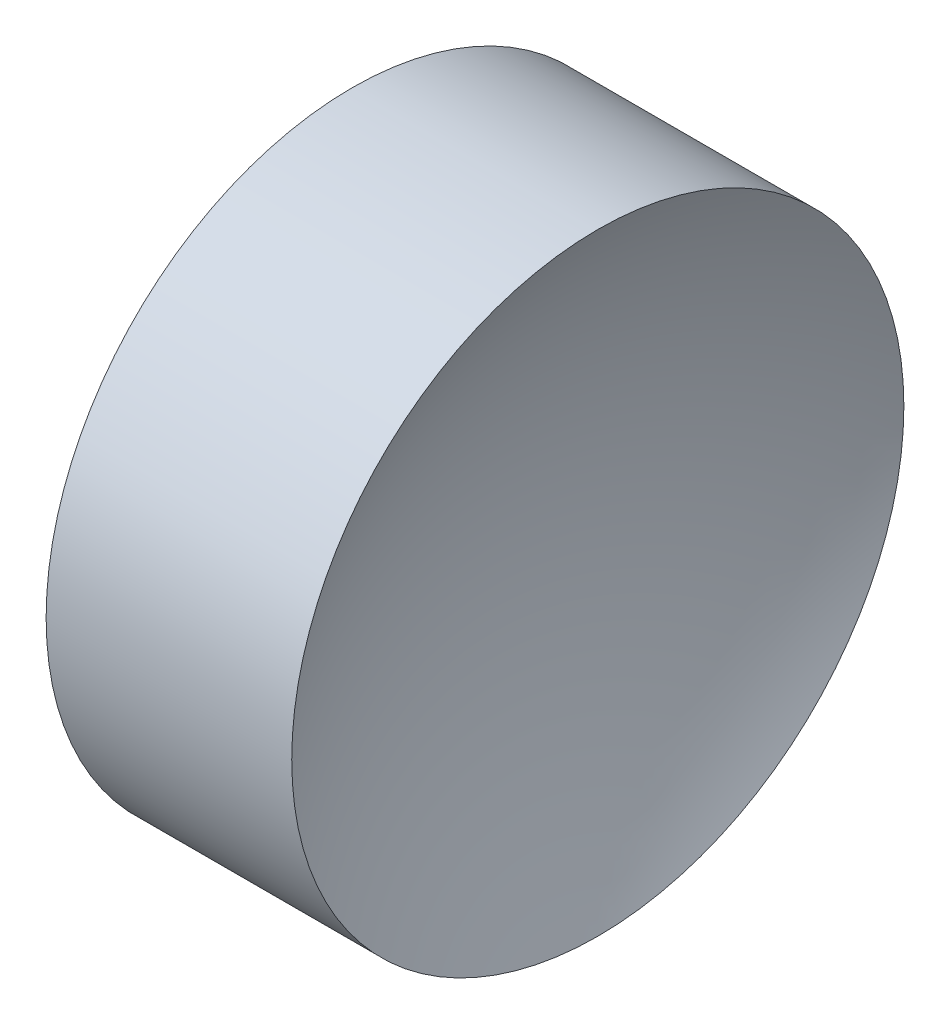
ISO-10303-21;
HEADER;
FILE_DESCRIPTION(('STEP AP214'),'2;1');
FILE_NAME('part.step','',(''),(''),'','','');
FILE_SCHEMA(('AUTOMOTIVE_DESIGN { 1 0 10303 214 1 1 1 1 }'));
ENDSEC;
DATA;
#1=APPLICATION_CONTEXT('core data for automotive mechanical design processes');
#2=APPLICATION_PROTOCOL_DEFINITION('international standard','automotive_design',2000,#1);
#3=PRODUCT_CONTEXT('',#1,'mechanical');
#4=PRODUCT('Part','Part','',(#3));
#5=PRODUCT_RELATED_PRODUCT_CATEGORY('part','',(#4));
#6=PRODUCT_DEFINITION_FORMATION('','',#4);
#7=PRODUCT_DEFINITION_CONTEXT('part definition',#1,'design');
#8=PRODUCT_DEFINITION('design','',#6,#7);
#9=PRODUCT_DEFINITION_SHAPE('','',#8);
#10=(LENGTH_UNIT() NAMED_UNIT(*) SI_UNIT(.MILLI.,.METRE.));
#11=(NAMED_UNIT(*) PLANE_ANGLE_UNIT() SI_UNIT($,.RADIAN.));
#12=(NAMED_UNIT(*) SI_UNIT($,.STERADIAN.) SOLID_ANGLE_UNIT());
#13=UNCERTAINTY_MEASURE_WITH_UNIT(LENGTH_MEASURE(1.E-05),#10,'distance_accuracy_value','');
#14=(GEOMETRIC_REPRESENTATION_CONTEXT(3) GLOBAL_UNCERTAINTY_ASSIGNED_CONTEXT((#13)) GLOBAL_UNIT_ASSIGNED_CONTEXT((#10,
#11,#12)) REPRESENTATION_CONTEXT('',''));
#15=CARTESIAN_POINT('',(0.,0.,0.));
#16=DIRECTION('',(0.,0.,1.));
#17=DIRECTION('',(1.,0.,0.));
#18=AXIS2_PLACEMENT_3D('',#15,#16,#17);
#19=CARTESIAN_POINT('',(12.694256363875,13.0445205745975,0.));
#20=DIRECTION('',(-1.,0.,0.));
#21=DIRECTION('',(0.,1.,0.));
#22=AXIS2_PLACEMENT_3D('',#19,#20,#21);
#23=SPHERICAL_SURFACE('',#22,10.58);
#24=CARTESIAN_POINT('',(22.018225475793,13.0445205745975,0.));
#25=DIRECTION('',(-1.,0.,0.));
#26=DIRECTION('',(0.,0.,1.));
#27=AXIS2_PLACEMENT_3D('',#24,#25,#26);
#28=CIRCLE('',#27,5.);
#29=CARTESIAN_POINT('',(22.018225475793,13.0445205745975,5.));
#30=VERTEX_POINT('',#29);
#31=EDGE_CURVE('E41',#30,#30,#28,.T.);
#32=ORIENTED_EDGE('',*,*,#31,.T.);
#33=EDGE_LOOP('',(#32));
#34=FACE_BOUND('',#33,.T.);
#35=ADVANCED_FACE('F35',(#34),#23,.F.);
#36=CARTESIAN_POINT('',(35.354256363875,13.0445205745975,0.));
#37=DIRECTION('',(-1.,0.,0.));
#38=DIRECTION('',(0.,1.,0.));
#39=AXIS2_PLACEMENT_3D('',#36,#37,#38);
#40=SPHERICAL_SURFACE('',#39,10.58);
#41=CARTESIAN_POINT('',(26.0302872519571,13.0445205745975,0.));
#42=DIRECTION('',(-1.,0.,0.));
#43=DIRECTION('',(0.,0.,1.));
#44=AXIS2_PLACEMENT_3D('',#41,#42,#43);
#45=CIRCLE('',#44,5.);
#46=CARTESIAN_POINT('',(26.0302872519571,13.0445205745975,5.));
#47=VERTEX_POINT('',#46);
#48=EDGE_CURVE('E10',#47,#47,#45,.T.);
#49=ORIENTED_EDGE('',*,*,#48,.F.);
#50=EDGE_LOOP('',(#49));
#51=FACE_BOUND('',#50,.T.);
#52=ADVANCED_FACE('F50',(#51),#40,.F.);
#53=CARTESIAN_POINT('',(21.2249305570684,13.0445205745975,0.));
#54=DIRECTION('',(-1.,0.,0.));
#55=DIRECTION('',(0.,0.,1.));
#56=AXIS2_PLACEMENT_3D('',#53,#54,#55);
#57=CYLINDRICAL_SURFACE('',#56,5.);
#58=ORIENTED_EDGE('',*,*,#31,.F.);
#59=EDGE_LOOP('',(#58));
#60=FACE_BOUND('',#59,.T.);
#61=ORIENTED_EDGE('',*,*,#48,.T.);
#62=EDGE_LOOP('',(#61));
#63=FACE_BOUND('',#62,.T.);
#64=ADVANCED_FACE('F48',(#60,#63),#57,.T.);
#65=CLOSED_SHELL('',(#35,#52,#64));
#66=MANIFOLD_SOLID_BREP('B2',#65);
#67=ADVANCED_BREP_SHAPE_REPRESENTATION('',(#18,#66),#14);
#68=SHAPE_DEFINITION_REPRESENTATION(#9,#67);
ENDSEC;
END-ISO-10303-21;
